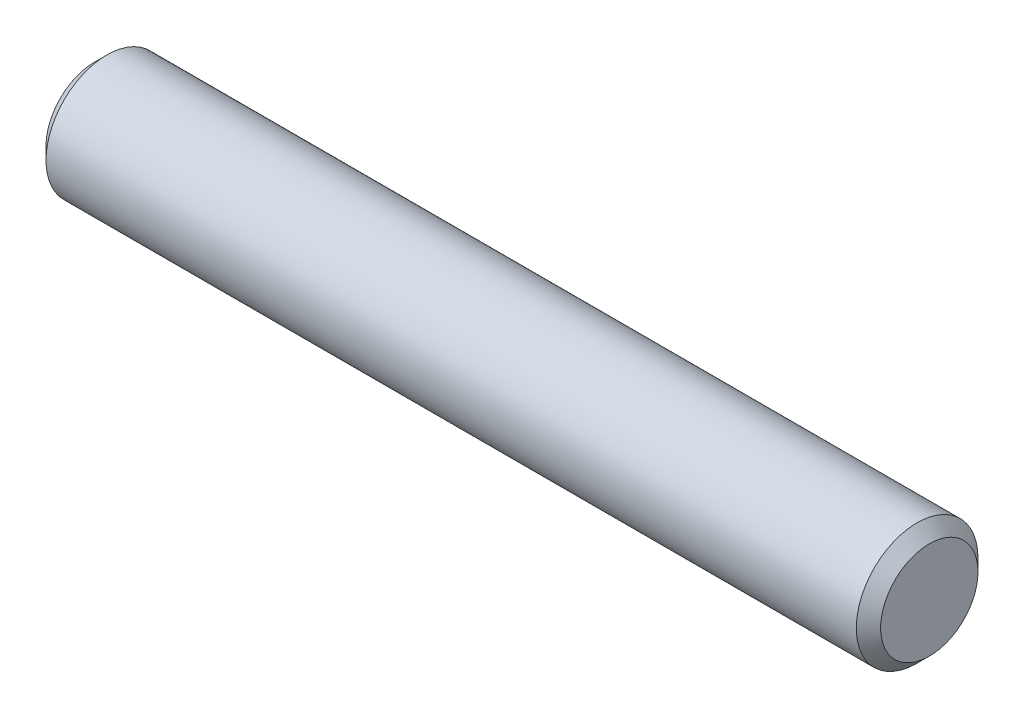
ISO-10303-21;
HEADER;
FILE_DESCRIPTION(('STEP AP214'),'2;1');
FILE_NAME('part.step','',(''),(''),'','','');
FILE_SCHEMA(('AUTOMOTIVE_DESIGN { 1 0 10303 214 1 1 1 1 }'));
ENDSEC;
DATA;
#1=APPLICATION_CONTEXT('core data for automotive mechanical design processes');
#2=APPLICATION_PROTOCOL_DEFINITION('international standard','automotive_design',2000,#1);
#3=PRODUCT_CONTEXT('',#1,'mechanical');
#4=PRODUCT('Part','Part','',(#3));
#5=PRODUCT_RELATED_PRODUCT_CATEGORY('part','',(#4));
#6=PRODUCT_DEFINITION_FORMATION('','',#4);
#7=PRODUCT_DEFINITION_CONTEXT('part definition',#1,'design');
#8=PRODUCT_DEFINITION('design','',#6,#7);
#9=PRODUCT_DEFINITION_SHAPE('','',#8);
#10=(LENGTH_UNIT() NAMED_UNIT(*) SI_UNIT(.MILLI.,.METRE.));
#11=(NAMED_UNIT(*) PLANE_ANGLE_UNIT() SI_UNIT($,.RADIAN.));
#12=(NAMED_UNIT(*) SI_UNIT($,.STERADIAN.) SOLID_ANGLE_UNIT());
#13=UNCERTAINTY_MEASURE_WITH_UNIT(LENGTH_MEASURE(1.E-05),#10,'distance_accuracy_value','');
#14=(GEOMETRIC_REPRESENTATION_CONTEXT(3) GLOBAL_UNCERTAINTY_ASSIGNED_CONTEXT((#13)) GLOBAL_UNIT_ASSIGNED_CONTEXT((#10,
#11,#12)) REPRESENTATION_CONTEXT('',''));
#15=CARTESIAN_POINT('',(0.,0.,0.));
#16=DIRECTION('',(0.,0.,1.));
#17=DIRECTION('',(1.,0.,0.));
#18=AXIS2_PLACEMENT_3D('',#15,#16,#17);
#19=CARTESIAN_POINT('',(-19.05,0.,0.));
#20=DIRECTION('',(1.,0.,0.));
#21=DIRECTION('',(0.,0.,-1.));
#22=AXIS2_PLACEMENT_3D('',#19,#20,#21);
#23=CYLINDRICAL_SURFACE('',#22,2.778125);
#24=CARTESIAN_POINT('',(18.494375,0.,0.));
#25=DIRECTION('',(1.,0.,0.));
#26=DIRECTION('',(0.,0.,-1.));
#27=AXIS2_PLACEMENT_3D('',#24,#25,#26);
#28=CIRCLE('',#27,2.778125);
#29=CARTESIAN_POINT('',(18.494375,0.,-2.778125));
#30=VERTEX_POINT('',#29);
#31=EDGE_CURVE('E36',#30,#30,#28,.F.);
#32=ORIENTED_EDGE('',*,*,#31,.T.);
#33=EDGE_LOOP('',(#32));
#34=FACE_BOUND('',#33,.T.);
#35=CARTESIAN_POINT('',(-18.494375,0.,0.));
#36=DIRECTION('',(1.,0.,0.));
#37=DIRECTION('',(0.,0.,-1.));
#38=AXIS2_PLACEMENT_3D('',#35,#36,#37);
#39=CIRCLE('',#38,2.778125);
#40=CARTESIAN_POINT('',(-18.494375,0.,-2.778125));
#41=VERTEX_POINT('',#40);
#42=EDGE_CURVE('E40',#41,#41,#39,.T.);
#43=ORIENTED_EDGE('',*,*,#42,.T.);
#44=EDGE_LOOP('',(#43));
#45=FACE_BOUND('',#44,.T.);
#46=ADVANCED_FACE('F29',(#34,#45),#23,.T.);
#47=CARTESIAN_POINT('',(-19.05,0.,0.));
#48=DIRECTION('',(1.,0.,0.));
#49=DIRECTION('',(0.,0.,-1.));
#50=AXIS2_PLACEMENT_3D('',#47,#48,#49);
#51=PLANE('',#50);
#52=CARTESIAN_POINT('',(-19.05,0.,0.));
#53=DIRECTION('',(1.,0.,0.));
#54=DIRECTION('',(0.,0.,-1.));
#55=AXIS2_PLACEMENT_3D('',#52,#53,#54);
#56=CIRCLE('',#55,2.22249999999998);
#57=CARTESIAN_POINT('',(-19.05,0.,-2.22249999999998));
#58=VERTEX_POINT('',#57);
#59=EDGE_CURVE('E10',#58,#58,#56,.F.);
#60=ORIENTED_EDGE('',*,*,#59,.T.);
#61=EDGE_LOOP('',(#60));
#62=FACE_BOUND('',#61,.T.);
#63=ADVANCED_FACE('F60',(#62),#51,.F.);
#64=CARTESIAN_POINT('',(19.05,0.,0.));
#65=DIRECTION('',(1.,0.,0.));
#66=DIRECTION('',(0.,0.,-1.));
#67=AXIS2_PLACEMENT_3D('',#64,#65,#66);
#68=PLANE('',#67);
#69=CARTESIAN_POINT('',(19.05,0.,0.));
#70=DIRECTION('',(1.,0.,0.));
#71=DIRECTION('',(0.,0.,-1.));
#72=AXIS2_PLACEMENT_3D('',#69,#70,#71);
#73=CIRCLE('',#72,2.22249999999999);
#74=CARTESIAN_POINT('',(19.05,0.,-2.22249999999999));
#75=VERTEX_POINT('',#74);
#76=EDGE_CURVE('E44',#75,#75,#73,.T.);
#77=ORIENTED_EDGE('',*,*,#76,.T.);
#78=EDGE_LOOP('',(#77));
#79=FACE_BOUND('',#78,.T.);
#80=ADVANCED_FACE('F50',(#79),#68,.T.);
#81=CARTESIAN_POINT('',(19.05,0.,0.));
#82=DIRECTION('',(-1.,0.,0.));
#83=DIRECTION('',(0.,0.,1.));
#84=AXIS2_PLACEMENT_3D('',#81,#82,#83);
#85=CONICAL_SURFACE('',#84,2.22249999999999,0.785398163397456);
#86=ORIENTED_EDGE('',*,*,#31,.F.);
#87=EDGE_LOOP('',(#86));
#88=FACE_BOUND('',#87,.T.);
#89=ORIENTED_EDGE('',*,*,#76,.F.);
#90=EDGE_LOOP('',(#89));
#91=FACE_BOUND('',#90,.T.);
#92=ADVANCED_FACE('F52',(#88,#91),#85,.T.);
#93=CARTESIAN_POINT('',(-18.494375,0.,0.));
#94=DIRECTION('',(1.,0.,0.));
#95=DIRECTION('',(0.,0.,-1.));
#96=AXIS2_PLACEMENT_3D('',#93,#94,#95);
#97=CONICAL_SURFACE('',#96,2.778125,0.785398163397453);
#98=ORIENTED_EDGE('',*,*,#59,.F.);
#99=EDGE_LOOP('',(#98));
#100=FACE_BOUND('',#99,.T.);
#101=ORIENTED_EDGE('',*,*,#42,.F.);
#102=EDGE_LOOP('',(#101));
#103=FACE_BOUND('',#102,.T.);
#104=ADVANCED_FACE('F31',(#100,#103),#97,.T.);
#105=CLOSED_SHELL('',(#46,#63,#80,#92,#104));
#106=MANIFOLD_SOLID_BREP('B2',#105);
#107=ADVANCED_BREP_SHAPE_REPRESENTATION('',(#18,#106),#14);
#108=SHAPE_DEFINITION_REPRESENTATION(#9,#107);
ENDSEC;
END-ISO-10303-21;
